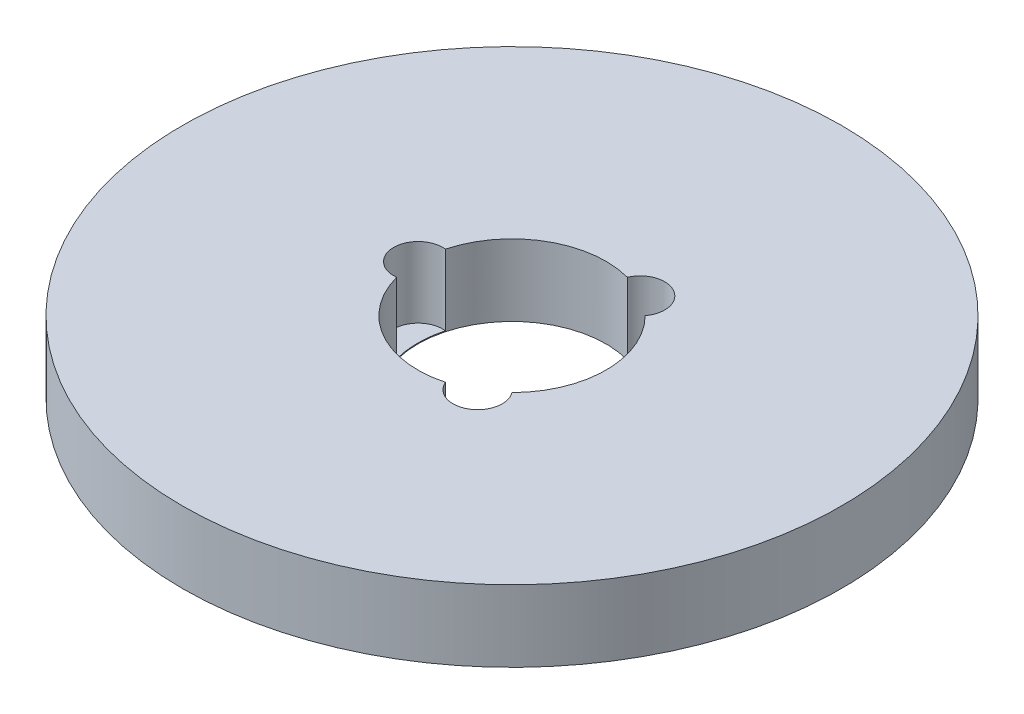
ISO-10303-21;
HEADER;
FILE_DESCRIPTION(('STEP AP214'),'2;1');
FILE_NAME('part.step','',(''),(''),'','','');
FILE_SCHEMA(('AUTOMOTIVE_DESIGN { 1 0 10303 214 1 1 1 1 }'));
ENDSEC;
DATA;
#1=APPLICATION_CONTEXT('core data for automotive mechanical design processes');
#2=APPLICATION_PROTOCOL_DEFINITION('international standard','automotive_design',2000,#1);
#3=PRODUCT_CONTEXT('',#1,'mechanical');
#4=PRODUCT('Part','Part','',(#3));
#5=PRODUCT_RELATED_PRODUCT_CATEGORY('part','',(#4));
#6=PRODUCT_DEFINITION_FORMATION('','',#4);
#7=PRODUCT_DEFINITION_CONTEXT('part definition',#1,'design');
#8=PRODUCT_DEFINITION('design','',#6,#7);
#9=PRODUCT_DEFINITION_SHAPE('','',#8);
#10=(LENGTH_UNIT() NAMED_UNIT(*) SI_UNIT(.MILLI.,.METRE.));
#11=(NAMED_UNIT(*) PLANE_ANGLE_UNIT() SI_UNIT($,.RADIAN.));
#12=(NAMED_UNIT(*) SI_UNIT($,.STERADIAN.) SOLID_ANGLE_UNIT());
#13=UNCERTAINTY_MEASURE_WITH_UNIT(LENGTH_MEASURE(1.E-05),#10,'distance_accuracy_value','');
#14=(GEOMETRIC_REPRESENTATION_CONTEXT(3) GLOBAL_UNCERTAINTY_ASSIGNED_CONTEXT((#13)) GLOBAL_UNIT_ASSIGNED_CONTEXT((#10,
#11,#12)) REPRESENTATION_CONTEXT('',''));
#15=CARTESIAN_POINT('',(0.,0.,0.));
#16=DIRECTION('',(0.,0.,1.));
#17=DIRECTION('',(1.,0.,0.));
#18=AXIS2_PLACEMENT_3D('',#15,#16,#17);
#19=CARTESIAN_POINT('',(0.,19.,0.));
#20=DIRECTION('',(0.,-1.,0.));
#21=DIRECTION('',(0.,0.,-1.));
#22=AXIS2_PLACEMENT_3D('',#19,#20,#21);
#23=CYLINDRICAL_SURFACE('',#22,87.5);
#24=CARTESIAN_POINT('',(0.,19.,0.));
#25=DIRECTION('',(0.,1.,0.));
#26=DIRECTION('',(0.,0.,1.));
#27=AXIS2_PLACEMENT_3D('',#24,#25,#26);
#28=CIRCLE('',#27,87.5);
#29=CARTESIAN_POINT('',(0.,19.,87.5));
#30=VERTEX_POINT('',#29);
#31=EDGE_CURVE('E126',#30,#30,#28,.T.);
#32=ORIENTED_EDGE('',*,*,#31,.F.);
#33=EDGE_LOOP('',(#32));
#34=FACE_BOUND('',#33,.T.);
#35=CARTESIAN_POINT('',(0.,0.,0.));
#36=DIRECTION('',(0.,1.,0.));
#37=DIRECTION('',(0.,0.,1.));
#38=AXIS2_PLACEMENT_3D('',#35,#36,#37);
#39=CIRCLE('',#38,87.5);
#40=CARTESIAN_POINT('',(0.,0.,87.5));
#41=VERTEX_POINT('',#40);
#42=EDGE_CURVE('E124',#41,#41,#39,.T.);
#43=ORIENTED_EDGE('',*,*,#42,.T.);
#44=EDGE_LOOP('',(#43));
#45=FACE_BOUND('',#44,.T.);
#46=ADVANCED_FACE('F39',(#34,#45),#23,.T.);
#47=CARTESIAN_POINT('',(0.,19.,0.));
#48=DIRECTION('',(0.,1.,0.));
#49=DIRECTION('',(0.,0.,1.));
#50=AXIS2_PLACEMENT_3D('',#47,#48,#49);
#51=PLANE('',#50);
#52=CARTESIAN_POINT('',(12.4553130692259,19.,21.5732350600758));
#53=DIRECTION('',(0.,1.,0.));
#54=DIRECTION('',(0.866025403784436,0.,-0.500000000000004));
#55=AXIS2_PLACEMENT_3D('',#52,#53,#54);
#56=CIRCLE('',#55,6.5126968358802);
#57=CARTESIAN_POINT('',(6.47296487218379,19.,24.147478662657));
#58=VERTEX_POINT('',#57);
#59=CARTESIAN_POINT('',(17.6758475231119,19.,17.6794913484438));
#60=VERTEX_POINT('',#59);
#61=EDGE_CURVE('E147',#58,#60,#56,.T.);
#62=ORIENTED_EDGE('',*,*,#61,.F.);
#63=CARTESIAN_POINT('',(0.,19.,0.));
#64=DIRECTION('',(0.,1.,0.));
#65=DIRECTION('',(0.,0.,1.));
#66=AXIS2_PLACEMENT_3D('',#63,#64,#65);
#67=CIRCLE('',#66,25.);
#68=CARTESIAN_POINT('',(-24.1488123952955,19.,6.46798731421315));
#69=VERTEX_POINT('',#68);
#70=EDGE_CURVE('E118',#69,#58,#67,.T.);
#71=ORIENTED_EDGE('',*,*,#70,.F.);
#72=CARTESIAN_POINT('',(-24.9106261384517,19.,0.));
#73=DIRECTION('',(0.,1.,0.));
#74=DIRECTION('',(0.,0.,1.));
#75=AXIS2_PLACEMENT_3D('',#72,#73,#74);
#76=CIRCLE('',#75,6.5126968358802);
#77=CARTESIAN_POINT('',(-24.1488123952955,19.,-6.46798731421315));
#78=VERTEX_POINT('',#77);
#79=EDGE_CURVE('E113',#78,#69,#76,.T.);
#80=ORIENTED_EDGE('',*,*,#79,.F.);
#81=CARTESIAN_POINT('',(6.47296487218345,19.,-24.1474786626571));
#82=VERTEX_POINT('',#81);
#83=EDGE_CURVE('E106',#82,#78,#67,.T.);
#84=ORIENTED_EDGE('',*,*,#83,.F.);
#85=CARTESIAN_POINT('',(12.4553130692256,19.,-21.5732350600759));
#86=DIRECTION('',(0.,1.,0.));
#87=DIRECTION('',(-0.866025403784443,0.,-0.499999999999992));
#88=AXIS2_PLACEMENT_3D('',#85,#86,#87);
#89=CIRCLE('',#88,6.5126968358802);
#90=CARTESIAN_POINT('',(17.6758475231117,19.,-17.679491348444));
#91=VERTEX_POINT('',#90);
#92=EDGE_CURVE('E90',#91,#82,#89,.T.);
#93=ORIENTED_EDGE('',*,*,#92,.F.);
#94=EDGE_CURVE('E116',#60,#91,#67,.T.);
#95=ORIENTED_EDGE('',*,*,#94,.F.);
#96=EDGE_LOOP('',(#62,#71,#80,#84,#93,#95));
#97=FACE_BOUND('',#96,.T.);
#98=ORIENTED_EDGE('',*,*,#31,.T.);
#99=EDGE_LOOP('',(#98));
#100=FACE_BOUND('',#99,.T.);
#101=ADVANCED_FACE('F115',(#97,#100),#51,.T.);
#102=CARTESIAN_POINT('',(0.,0.,0.));
#103=DIRECTION('',(0.,1.,0.));
#104=DIRECTION('',(0.,0.,1.));
#105=AXIS2_PLACEMENT_3D('',#102,#103,#104);
#106=PLANE('',#105);
#107=CARTESIAN_POINT('',(0.,0.,0.));
#108=DIRECTION('',(0.,1.,0.));
#109=DIRECTION('',(0.,0.,1.));
#110=AXIS2_PLACEMENT_3D('',#107,#108,#109);
#111=CIRCLE('',#110,25.);
#112=CARTESIAN_POINT('',(0.,0.,25.));
#113=VERTEX_POINT('',#112);
#114=EDGE_CURVE('E120',#113,#113,#111,.T.);
#115=ORIENTED_EDGE('',*,*,#114,.T.);
#116=EDGE_LOOP('',(#115));
#117=FACE_BOUND('',#116,.T.);
#118=ORIENTED_EDGE('',*,*,#42,.F.);
#119=EDGE_LOOP('',(#118));
#120=FACE_BOUND('',#119,.T.);
#121=ADVANCED_FACE('F164',(#117,#120),#106,.F.);
#122=CARTESIAN_POINT('',(0.,19.,0.));
#123=DIRECTION('',(0.,-1.,0.));
#124=DIRECTION('',(0.,0.,-1.));
#125=AXIS2_PLACEMENT_3D('',#122,#123,#124);
#126=CYLINDRICAL_SURFACE('',#125,25.);
#127=DIRECTION('',(0.,1.,0.));
#128=VECTOR('',#127,1.);
#129=CARTESIAN_POINT('',(6.47296487218379,9.61465566993603,24.147478662657));
#130=LINE('',#129,#128);
#131=CARTESIAN_POINT('',(6.47296487218379,0.22931133987206,24.147478662657));
#132=VERTEX_POINT('',#131);
#133=EDGE_CURVE('E11',#132,#58,#130,.T.);
#134=ORIENTED_EDGE('',*,*,#133,.F.);
#135=CARTESIAN_POINT('',(0.,0.22931133987206,0.));
#136=DIRECTION('',(0.,1.,0.));
#137=DIRECTION('',(0.,0.,1.));
#138=AXIS2_PLACEMENT_3D('',#135,#136,#137);
#139=CIRCLE('',#138,25.);
#140=CARTESIAN_POINT('',(17.6758475231119,0.22931133987206,17.6794913484438));
#141=VERTEX_POINT('',#140);
#142=EDGE_CURVE('E144',#132,#141,#139,.T.);
#143=ORIENTED_EDGE('',*,*,#142,.T.);
#144=DIRECTION('',(0.,1.,0.));
#145=VECTOR('',#144,1.);
#146=CARTESIAN_POINT('',(17.6758475231119,9.61465566993603,17.6794913484438));
#147=LINE('',#146,#145);
#148=EDGE_CURVE('E46',#60,#141,#147,.F.);
#149=ORIENTED_EDGE('',*,*,#148,.F.);
#150=ORIENTED_EDGE('',*,*,#94,.T.);
#151=DIRECTION('',(0.,1.,0.));
#152=VECTOR('',#151,1.);
#153=CARTESIAN_POINT('',(17.6758475231117,9.61465566993603,-17.679491348444));
#154=LINE('',#153,#152);
#155=CARTESIAN_POINT('',(17.6758475231117,0.22931133987206,-17.679491348444));
#156=VERTEX_POINT('',#155);
#157=EDGE_CURVE('E92',#156,#91,#154,.T.);
#158=ORIENTED_EDGE('',*,*,#157,.F.);
#159=CARTESIAN_POINT('',(0.,0.22931133987206,0.));
#160=DIRECTION('',(0.,1.,0.));
#161=DIRECTION('',(0.,0.,1.));
#162=AXIS2_PLACEMENT_3D('',#159,#160,#161);
#163=CIRCLE('',#162,25.);
#164=CARTESIAN_POINT('',(6.47296487218345,0.22931133987206,-24.1474786626571));
#165=VERTEX_POINT('',#164);
#166=EDGE_CURVE('E107',#156,#165,#163,.T.);
#167=ORIENTED_EDGE('',*,*,#166,.T.);
#168=DIRECTION('',(0.,1.,0.));
#169=VECTOR('',#168,1.);
#170=CARTESIAN_POINT('',(6.47296487218345,9.61465566993603,-24.1474786626571));
#171=LINE('',#170,#169);
#172=EDGE_CURVE('E95',#82,#165,#171,.F.);
#173=ORIENTED_EDGE('',*,*,#172,.F.);
#174=ORIENTED_EDGE('',*,*,#83,.T.);
#175=DIRECTION('',(0.,1.,0.));
#176=VECTOR('',#175,1.);
#177=CARTESIAN_POINT('',(-24.1488123952955,9.61465566993603,-6.46798731421315));
#178=LINE('',#177,#176);
#179=CARTESIAN_POINT('',(-24.1488123952955,0.22931133987206,-6.46798731421315));
#180=VERTEX_POINT('',#179);
#181=EDGE_CURVE('E143',#180,#78,#178,.T.);
#182=ORIENTED_EDGE('',*,*,#181,.F.);
#183=CARTESIAN_POINT('',(0.,0.22931133987206,0.));
#184=DIRECTION('',(0.,1.,0.));
#185=DIRECTION('',(0.,0.,1.));
#186=AXIS2_PLACEMENT_3D('',#183,#184,#185);
#187=CIRCLE('',#186,25.);
#188=CARTESIAN_POINT('',(-24.1488123952955,0.22931133987206,6.46798731421315));
#189=VERTEX_POINT('',#188);
#190=EDGE_CURVE('E132',#180,#189,#187,.T.);
#191=ORIENTED_EDGE('',*,*,#190,.T.);
#192=DIRECTION('',(0.,1.,0.));
#193=VECTOR('',#192,1.);
#194=CARTESIAN_POINT('',(-24.1488123952955,9.61465566993603,6.46798731421315));
#195=LINE('',#194,#193);
#196=EDGE_CURVE('E137',#69,#189,#195,.F.);
#197=ORIENTED_EDGE('',*,*,#196,.F.);
#198=ORIENTED_EDGE('',*,*,#70,.T.);
#199=EDGE_LOOP('',(#134,#143,#149,#150,#158,#167,#173,#174,#182,#191,#197,#198));
#200=FACE_BOUND('',#199,.T.);
#201=ORIENTED_EDGE('',*,*,#114,.F.);
#202=EDGE_LOOP('',(#201));
#203=FACE_BOUND('',#202,.T.);
#204=ADVANCED_FACE('F103',(#200,#203),#126,.F.);
#205=CARTESIAN_POINT('',(-24.9106261384517,0.22931133987206,0.));
#206=DIRECTION('',(0.,1.,0.));
#207=DIRECTION('',(0.,0.,1.));
#208=AXIS2_PLACEMENT_3D('',#205,#206,#207);
#209=CYLINDRICAL_SURFACE('',#208,6.5126968358802);
#210=ORIENTED_EDGE('',*,*,#181,.T.);
#211=ORIENTED_EDGE('',*,*,#79,.T.);
#212=ORIENTED_EDGE('',*,*,#196,.T.);
#213=CARTESIAN_POINT('',(-24.9106261384517,0.22931133987206,0.));
#214=DIRECTION('',(0.,1.,0.));
#215=DIRECTION('',(0.,0.,1.));
#216=AXIS2_PLACEMENT_3D('',#213,#214,#215);
#217=CIRCLE('',#216,6.5126968358802);
#218=EDGE_CURVE('E121',#180,#189,#217,.T.);
#219=ORIENTED_EDGE('',*,*,#218,.F.);
#220=EDGE_LOOP('',(#210,#211,#212,#219));
#221=FACE_BOUND('',#220,.T.);
#222=ADVANCED_FACE('F174',(#221),#209,.F.);
#223=CARTESIAN_POINT('',(-24.9106261384517,0.22931133987206,0.));
#224=DIRECTION('',(0.,1.,0.));
#225=DIRECTION('',(0.,0.,1.));
#226=AXIS2_PLACEMENT_3D('',#223,#224,#225);
#227=PLANE('',#226);
#228=ORIENTED_EDGE('',*,*,#218,.T.);
#229=ORIENTED_EDGE('',*,*,#190,.F.);
#230=EDGE_LOOP('',(#228,#229));
#231=FACE_BOUND('',#230,.T.);
#232=ADVANCED_FACE('F177',(#231),#227,.T.);
#233=CARTESIAN_POINT('',(12.4553130692256,0.22931133987206,-21.5732350600759));
#234=DIRECTION('',(0.,1.,0.));
#235=DIRECTION('',(0.,0.,1.));
#236=AXIS2_PLACEMENT_3D('',#233,#234,#235);
#237=CYLINDRICAL_SURFACE('',#236,6.5126968358802);
#238=ORIENTED_EDGE('',*,*,#157,.T.);
#239=ORIENTED_EDGE('',*,*,#92,.T.);
#240=ORIENTED_EDGE('',*,*,#172,.T.);
#241=CARTESIAN_POINT('',(12.4553130692256,0.22931133987206,-21.5732350600759));
#242=DIRECTION('',(0.,1.,0.));
#243=DIRECTION('',(-0.866025403784443,0.,-0.499999999999992));
#244=AXIS2_PLACEMENT_3D('',#241,#242,#243);
#245=CIRCLE('',#244,6.5126968358802);
#246=EDGE_CURVE('E56',#156,#165,#245,.T.);
#247=ORIENTED_EDGE('',*,*,#246,.F.);
#248=EDGE_LOOP('',(#238,#239,#240,#247));
#249=FACE_BOUND('',#248,.T.);
#250=ADVANCED_FACE('F93',(#249),#237,.F.);
#251=CARTESIAN_POINT('',(12.4553130692256,0.22931133987206,-21.5732350600759));
#252=DIRECTION('',(0.,1.,0.));
#253=DIRECTION('',(-0.866025403784443,0.,-0.499999999999992));
#254=AXIS2_PLACEMENT_3D('',#251,#252,#253);
#255=PLANE('',#254);
#256=ORIENTED_EDGE('',*,*,#246,.T.);
#257=ORIENTED_EDGE('',*,*,#166,.F.);
#258=EDGE_LOOP('',(#256,#257));
#259=FACE_BOUND('',#258,.T.);
#260=ADVANCED_FACE('F160',(#259),#255,.T.);
#261=CARTESIAN_POINT('',(12.4553130692259,0.22931133987206,21.5732350600758));
#262=DIRECTION('',(0.,1.,0.));
#263=DIRECTION('',(0.,0.,1.));
#264=AXIS2_PLACEMENT_3D('',#261,#262,#263);
#265=CYLINDRICAL_SURFACE('',#264,6.5126968358802);
#266=ORIENTED_EDGE('',*,*,#133,.T.);
#267=ORIENTED_EDGE('',*,*,#61,.T.);
#268=ORIENTED_EDGE('',*,*,#148,.T.);
#269=CARTESIAN_POINT('',(12.4553130692259,0.22931133987206,21.5732350600758));
#270=DIRECTION('',(0.,1.,0.));
#271=DIRECTION('',(0.866025403784436,0.,-0.500000000000004));
#272=AXIS2_PLACEMENT_3D('',#269,#270,#271);
#273=CIRCLE('',#272,6.5126968358802);
#274=EDGE_CURVE('E55',#132,#141,#273,.T.);
#275=ORIENTED_EDGE('',*,*,#274,.F.);
#276=EDGE_LOOP('',(#266,#267,#268,#275));
#277=FACE_BOUND('',#276,.T.);
#278=ADVANCED_FACE('F149',(#277),#265,.F.);
#279=CARTESIAN_POINT('',(12.4553130692259,0.22931133987206,21.5732350600758));
#280=DIRECTION('',(0.,1.,0.));
#281=DIRECTION('',(0.866025403784436,0.,-0.500000000000004));
#282=AXIS2_PLACEMENT_3D('',#279,#280,#281);
#283=PLANE('',#282);
#284=ORIENTED_EDGE('',*,*,#274,.T.);
#285=ORIENTED_EDGE('',*,*,#142,.F.);
#286=EDGE_LOOP('',(#284,#285));
#287=FACE_BOUND('',#286,.T.);
#288=ADVANCED_FACE('F151',(#287),#283,.T.);
#289=CLOSED_SHELL('',(#46,#101,#121,#204,#222,#232,#250,#260,#278,#288));
#290=MANIFOLD_SOLID_BREP('B2',#289);
#291=ADVANCED_BREP_SHAPE_REPRESENTATION('',(#18,#290),#14);
#292=SHAPE_DEFINITION_REPRESENTATION(#9,#291);
ENDSEC;
END-ISO-10303-21;
